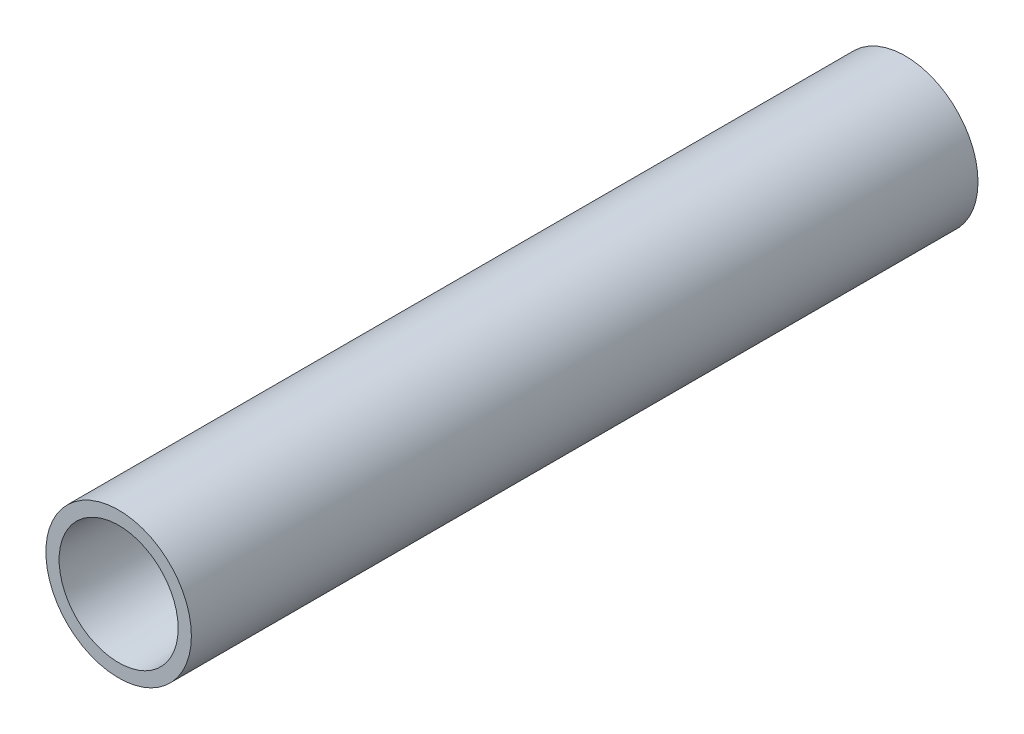
ISO-10303-21;
HEADER;
FILE_DESCRIPTION(('STEP AP214'),'2;1');
FILE_NAME('part.step','',(''),(''),'','','');
FILE_SCHEMA(('AUTOMOTIVE_DESIGN { 1 0 10303 214 1 1 1 1 }'));
ENDSEC;
DATA;
#1=APPLICATION_CONTEXT('core data for automotive mechanical design processes');
#2=APPLICATION_PROTOCOL_DEFINITION('international standard','automotive_design',2000,#1);
#3=PRODUCT_CONTEXT('',#1,'mechanical');
#4=PRODUCT('Part','Part','',(#3));
#5=PRODUCT_RELATED_PRODUCT_CATEGORY('part','',(#4));
#6=PRODUCT_DEFINITION_FORMATION('','',#4);
#7=PRODUCT_DEFINITION_CONTEXT('part definition',#1,'design');
#8=PRODUCT_DEFINITION('design','',#6,#7);
#9=PRODUCT_DEFINITION_SHAPE('','',#8);
#10=(LENGTH_UNIT() NAMED_UNIT(*) SI_UNIT(.MILLI.,.METRE.));
#11=(NAMED_UNIT(*) PLANE_ANGLE_UNIT() SI_UNIT($,.RADIAN.));
#12=(NAMED_UNIT(*) SI_UNIT($,.STERADIAN.) SOLID_ANGLE_UNIT());
#13=UNCERTAINTY_MEASURE_WITH_UNIT(LENGTH_MEASURE(1.E-05),#10,'distance_accuracy_value','');
#14=(GEOMETRIC_REPRESENTATION_CONTEXT(3) GLOBAL_UNCERTAINTY_ASSIGNED_CONTEXT((#13)) GLOBAL_UNIT_ASSIGNED_CONTEXT((#10,
#11,#12)) REPRESENTATION_CONTEXT('',''));
#15=CARTESIAN_POINT('',(0.,0.,0.));
#16=DIRECTION('',(0.,0.,1.));
#17=DIRECTION('',(1.,0.,0.));
#18=AXIS2_PLACEMENT_3D('',#15,#16,#17);
#19=CARTESIAN_POINT('',(0.,0.,30.));
#20=DIRECTION('',(0.,0.,-1.));
#21=DIRECTION('',(-1.,0.,0.));
#22=AXIS2_PLACEMENT_3D('',#19,#20,#21);
#23=CYLINDRICAL_SURFACE('',#22,1.);
#24=CARTESIAN_POINT('',(0.,0.,5.68));
#25=DIRECTION('',(0.,0.,1.));
#26=DIRECTION('',(1.,0.,0.));
#27=AXIS2_PLACEMENT_3D('',#24,#25,#26);
#28=CIRCLE('',#27,1.);
#29=CARTESIAN_POINT('',(1.,0.,5.68));
#30=VERTEX_POINT('',#29);
#31=EDGE_CURVE('E56',#30,#30,#28,.F.);
#32=ORIENTED_EDGE('',*,*,#31,.T.);
#33=EDGE_LOOP('',(#32));
#34=FACE_BOUND('',#33,.T.);
#35=CARTESIAN_POINT('',(0.,0.,24.32));
#36=DIRECTION('',(0.,0.,1.));
#37=DIRECTION('',(1.,0.,0.));
#38=AXIS2_PLACEMENT_3D('',#35,#36,#37);
#39=CIRCLE('',#38,1.);
#40=CARTESIAN_POINT('',(1.,0.,24.32));
#41=VERTEX_POINT('',#40);
#42=EDGE_CURVE('E41',#41,#41,#39,.T.);
#43=ORIENTED_EDGE('',*,*,#42,.T.);
#44=EDGE_LOOP('',(#43));
#45=FACE_BOUND('',#44,.T.);
#46=ADVANCED_FACE('F37',(#34,#45),#23,.F.);
#47=CARTESIAN_POINT('',(0.,0.,30.));
#48=DIRECTION('',(0.,0.,-1.));
#49=DIRECTION('',(-1.,0.,0.));
#50=AXIS2_PLACEMENT_3D('',#47,#48,#49);
#51=CYLINDRICAL_SURFACE('',#50,2.775);
#52=CARTESIAN_POINT('',(0.,0.,30.));
#53=DIRECTION('',(0.,0.,1.));
#54=DIRECTION('',(1.,0.,0.));
#55=AXIS2_PLACEMENT_3D('',#52,#53,#54);
#56=CIRCLE('',#55,2.775);
#57=CARTESIAN_POINT('',(2.775,0.,30.));
#58=VERTEX_POINT('',#57);
#59=EDGE_CURVE('E10',#58,#58,#56,.T.);
#60=ORIENTED_EDGE('',*,*,#59,.F.);
#61=EDGE_LOOP('',(#60));
#62=FACE_BOUND('',#61,.T.);
#63=CARTESIAN_POINT('',(0.,0.,0.));
#64=DIRECTION('',(0.,0.,1.));
#65=DIRECTION('',(1.,0.,0.));
#66=AXIS2_PLACEMENT_3D('',#63,#64,#65);
#67=CIRCLE('',#66,2.775);
#68=CARTESIAN_POINT('',(2.775,0.,0.));
#69=VERTEX_POINT('',#68);
#70=EDGE_CURVE('E46',#69,#69,#67,.T.);
#71=ORIENTED_EDGE('',*,*,#70,.T.);
#72=EDGE_LOOP('',(#71));
#73=FACE_BOUND('',#72,.T.);
#74=ADVANCED_FACE('F39',(#62,#73),#51,.T.);
#75=CARTESIAN_POINT('',(0.,0.,30.));
#76=DIRECTION('',(0.,0.,1.));
#77=DIRECTION('',(1.,0.,0.));
#78=AXIS2_PLACEMENT_3D('',#75,#76,#77);
#79=PLANE('',#78);
#80=CARTESIAN_POINT('',(0.,0.,30.));
#81=DIRECTION('',(0.,0.,1.));
#82=DIRECTION('',(1.,0.,0.));
#83=AXIS2_PLACEMENT_3D('',#80,#81,#82);
#84=CIRCLE('',#83,2.27);
#85=CARTESIAN_POINT('',(2.27,0.,30.));
#86=VERTEX_POINT('',#85);
#87=EDGE_CURVE('E71',#86,#86,#84,.T.);
#88=ORIENTED_EDGE('',*,*,#87,.F.);
#89=EDGE_LOOP('',(#88));
#90=FACE_BOUND('',#89,.T.);
#91=ORIENTED_EDGE('',*,*,#59,.T.);
#92=EDGE_LOOP('',(#91));
#93=FACE_BOUND('',#92,.T.);
#94=ADVANCED_FACE('F82',(#90,#93),#79,.T.);
#95=CARTESIAN_POINT('',(0.,0.,0.));
#96=DIRECTION('',(0.,0.,1.));
#97=DIRECTION('',(1.,0.,0.));
#98=AXIS2_PLACEMENT_3D('',#95,#96,#97);
#99=PLANE('',#98);
#100=CARTESIAN_POINT('',(0.,0.,0.));
#101=DIRECTION('',(0.,0.,1.));
#102=DIRECTION('',(1.,0.,0.));
#103=AXIS2_PLACEMENT_3D('',#100,#101,#102);
#104=CIRCLE('',#103,2.27);
#105=CARTESIAN_POINT('',(2.27,0.,0.));
#106=VERTEX_POINT('',#105);
#107=EDGE_CURVE('E59',#106,#106,#104,.T.);
#108=ORIENTED_EDGE('',*,*,#107,.T.);
#109=EDGE_LOOP('',(#108));
#110=FACE_BOUND('',#109,.T.);
#111=ORIENTED_EDGE('',*,*,#70,.F.);
#112=EDGE_LOOP('',(#111));
#113=FACE_BOUND('',#112,.T.);
#114=ADVANCED_FACE('F84',(#110,#113),#99,.F.);
#115=CARTESIAN_POINT('',(0.,0.,0.));
#116=DIRECTION('',(0.,0.,-1.));
#117=DIRECTION('',(1.,0.,0.));
#118=AXIS2_PLACEMENT_3D('',#115,#116,#117);
#119=CONICAL_SURFACE('',#118,2.27,0.0536514212063058);
#120=CARTESIAN_POINT('',(0.,0.,5.68));
#121=DIRECTION('',(0.,0.,1.));
#122=DIRECTION('',(1.,0.,0.));
#123=AXIS2_PLACEMENT_3D('',#120,#121,#122);
#124=CIRCLE('',#123,1.9649671949344);
#125=CARTESIAN_POINT('',(1.9649671949344,0.,5.68));
#126=VERTEX_POINT('',#125);
#127=EDGE_CURVE('E52',#126,#126,#124,.T.);
#128=ORIENTED_EDGE('',*,*,#127,.T.);
#129=EDGE_LOOP('',(#128));
#130=FACE_BOUND('',#129,.T.);
#131=ORIENTED_EDGE('',*,*,#107,.F.);
#132=EDGE_LOOP('',(#131));
#133=FACE_BOUND('',#132,.T.);
#134=ADVANCED_FACE('F90',(#130,#133),#119,.F.);
#135=CARTESIAN_POINT('',(0.,0.,5.68));
#136=DIRECTION('',(0.,0.,1.));
#137=DIRECTION('',(1.,0.,0.));
#138=AXIS2_PLACEMENT_3D('',#135,#136,#137);
#139=PLANE('',#138);
#140=ORIENTED_EDGE('',*,*,#31,.F.);
#141=EDGE_LOOP('',(#140));
#142=FACE_BOUND('',#141,.T.);
#143=ORIENTED_EDGE('',*,*,#127,.F.);
#144=EDGE_LOOP('',(#143));
#145=FACE_BOUND('',#144,.T.);
#146=ADVANCED_FACE('F101',(#142,#145),#139,.F.);
#147=CARTESIAN_POINT('',(0.,0.,30.));
#148=DIRECTION('',(0.,0.,1.));
#149=DIRECTION('',(1.,0.,0.));
#150=AXIS2_PLACEMENT_3D('',#147,#148,#149);
#151=CONICAL_SURFACE('',#150,2.27,0.0536514212063058);
#152=CARTESIAN_POINT('',(0.,0.,24.32));
#153=DIRECTION('',(0.,0.,1.));
#154=DIRECTION('',(1.,0.,0.));
#155=AXIS2_PLACEMENT_3D('',#152,#153,#154);
#156=CIRCLE('',#155,1.9649671949344);
#157=CARTESIAN_POINT('',(1.9649671949344,0.,24.32));
#158=VERTEX_POINT('',#157);
#159=EDGE_CURVE('E66',#158,#158,#156,.T.);
#160=ORIENTED_EDGE('',*,*,#159,.F.);
#161=EDGE_LOOP('',(#160));
#162=FACE_BOUND('',#161,.T.);
#163=ORIENTED_EDGE('',*,*,#87,.T.);
#164=EDGE_LOOP('',(#163));
#165=FACE_BOUND('',#164,.T.);
#166=ADVANCED_FACE('F80',(#162,#165),#151,.F.);
#167=CARTESIAN_POINT('',(0.,0.,24.32));
#168=DIRECTION('',(0.,0.,1.));
#169=DIRECTION('',(1.,0.,0.));
#170=AXIS2_PLACEMENT_3D('',#167,#168,#169);
#171=PLANE('',#170);
#172=ORIENTED_EDGE('',*,*,#42,.F.);
#173=EDGE_LOOP('',(#172));
#174=FACE_BOUND('',#173,.T.);
#175=ORIENTED_EDGE('',*,*,#159,.T.);
#176=EDGE_LOOP('',(#175));
#177=FACE_BOUND('',#176,.T.);
#178=ADVANCED_FACE('F129',(#174,#177),#171,.T.);
#179=CLOSED_SHELL('',(#46,#74,#94,#114,#134,#146,#166,#178));
#180=MANIFOLD_SOLID_BREP('B2',#179);
#181=ADVANCED_BREP_SHAPE_REPRESENTATION('',(#18,#180),#14);
#182=SHAPE_DEFINITION_REPRESENTATION(#9,#181);
ENDSEC;
END-ISO-10303-21;
